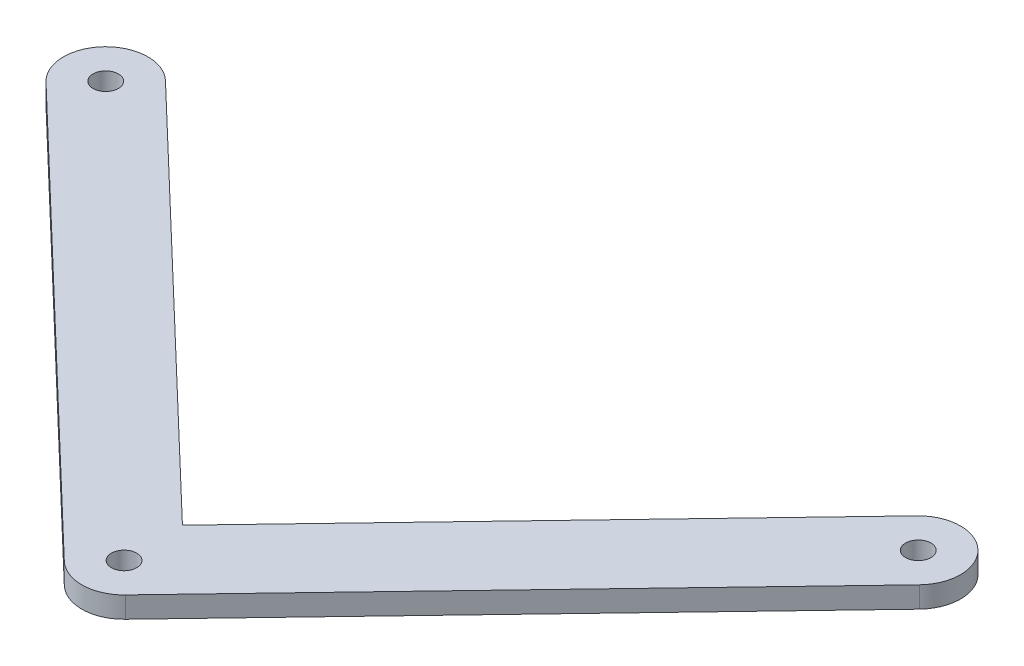
ISO-10303-21;
HEADER;
FILE_DESCRIPTION(('STEP AP214'),'2;1');
FILE_NAME('part.step','',(''),(''),'','','');
FILE_SCHEMA(('AUTOMOTIVE_DESIGN { 1 0 10303 214 1 1 1 1 }'));
ENDSEC;
DATA;
#1=APPLICATION_CONTEXT('core data for automotive mechanical design processes');
#2=APPLICATION_PROTOCOL_DEFINITION('international standard','automotive_design',2000,#1);
#3=PRODUCT_CONTEXT('',#1,'mechanical');
#4=PRODUCT('Part','Part','',(#3));
#5=PRODUCT_RELATED_PRODUCT_CATEGORY('part','',(#4));
#6=PRODUCT_DEFINITION_FORMATION('','',#4);
#7=PRODUCT_DEFINITION_CONTEXT('part definition',#1,'design');
#8=PRODUCT_DEFINITION('design','',#6,#7);
#9=PRODUCT_DEFINITION_SHAPE('','',#8);
#10=(LENGTH_UNIT() NAMED_UNIT(*) SI_UNIT(.MILLI.,.METRE.));
#11=(NAMED_UNIT(*) PLANE_ANGLE_UNIT() SI_UNIT($,.RADIAN.));
#12=(NAMED_UNIT(*) SI_UNIT($,.STERADIAN.) SOLID_ANGLE_UNIT());
#13=UNCERTAINTY_MEASURE_WITH_UNIT(LENGTH_MEASURE(1.E-05),#10,'distance_accuracy_value','');
#14=(GEOMETRIC_REPRESENTATION_CONTEXT(3) GLOBAL_UNCERTAINTY_ASSIGNED_CONTEXT((#13)) GLOBAL_UNIT_ASSIGNED_CONTEXT((#10,
#11,#12)) REPRESENTATION_CONTEXT('',''));
#15=CARTESIAN_POINT('',(0.,0.,0.));
#16=DIRECTION('',(0.,0.,1.));
#17=DIRECTION('',(1.,0.,0.));
#18=AXIS2_PLACEMENT_3D('',#15,#16,#17);
#19=CARTESIAN_POINT('',(0.,5.,0.));
#20=DIRECTION('',(0.,1.,0.));
#21=DIRECTION('',(0.,0.,1.));
#22=AXIS2_PLACEMENT_3D('',#19,#20,#21);
#23=PLANE('',#22);
#24=CARTESIAN_POINT('',(91.9483948435388,5.,-96.0962678031602));
#25=DIRECTION('',(0.,1.,0.));
#26=DIRECTION('',(0.,0.,1.));
#27=AXIS2_PLACEMENT_3D('',#24,#25,#26);
#28=CIRCLE('',#27,3.00000000000001);
#29=CARTESIAN_POINT('',(91.9483948435388,5.,-93.0962678031602));
#30=VERTEX_POINT('',#29);
#31=EDGE_CURVE('E170',#30,#30,#28,.T.);
#32=ORIENTED_EDGE('',*,*,#31,.F.);
#33=EDGE_LOOP('',(#32));
#34=FACE_BOUND('',#33,.T.);
#35=CARTESIAN_POINT('',(0.,5.,0.));
#36=DIRECTION('',(0.,1.,0.));
#37=DIRECTION('',(0.,0.,1.));
#38=AXIS2_PLACEMENT_3D('',#35,#36,#37);
#39=CIRCLE('',#38,10.);
#40=CARTESIAN_POINT('',(-6.91340056137843,5.,7.2252953349972));
#41=VERTEX_POINT('',#40);
#42=CARTESIAN_POINT('',(7.22528329347069,5.,6.91341314613074));
#43=VERTEX_POINT('',#42);
#44=EDGE_CURVE('E143',#41,#43,#39,.T.);
#45=ORIENTED_EDGE('',*,*,#44,.T.);
#46=DIRECTION('',(0.691341314613074,0.,-0.722528329347069));
#47=VECTOR('',#46,1.);
#48=CARTESIAN_POINT('',(7.22528329347069,5.,6.91341314613074));
#49=LINE('',#48,#47);
#50=CARTESIAN_POINT('',(99.1736781370095,5.,-89.1828546570295));
#51=VERTEX_POINT('',#50);
#52=EDGE_CURVE('E96',#43,#51,#49,.T.);
#53=ORIENTED_EDGE('',*,*,#52,.T.);
#54=CARTESIAN_POINT('',(91.9483948435388,5.,-96.0962678031602));
#55=DIRECTION('',(0.,1.,0.));
#56=DIRECTION('',(0.,0.,1.));
#57=AXIS2_PLACEMENT_3D('',#54,#55,#56);
#58=CIRCLE('',#57,10.);
#59=CARTESIAN_POINT('',(84.7231115500681,5.,-103.009680949291));
#60=VERTEX_POINT('',#59);
#61=EDGE_CURVE('E155',#51,#60,#58,.T.);
#62=ORIENTED_EDGE('',*,*,#61,.T.);
#63=DIRECTION('',(-0.691341314613074,0.,0.722528329347069));
#64=VECTOR('',#63,1.);
#65=CARTESIAN_POINT('',(-0.311882188866944,5.,-14.1386838548706));
#66=LINE('',#65,#64);
#67=CARTESIAN_POINT('',(-0.311882188866944,5.,-14.1386838548706));
#68=VERTEX_POINT('',#67);
#69=EDGE_CURVE('E112',#60,#68,#66,.T.);
#70=ORIENTED_EDGE('',*,*,#69,.T.);
#71=DIRECTION('',(-0.722529533499721,0.,-0.691340056137843));
#72=VECTOR('',#71,1.);
#73=CARTESIAN_POINT('',(-93.5182045950828,5.,-103.321563138157));
#74=LINE('',#73,#72);
#75=CARTESIAN_POINT('',(-93.5182045950828,5.,-103.321563138157));
#76=VERTEX_POINT('',#75);
#77=EDGE_CURVE('E106',#68,#76,#74,.T.);
#78=ORIENTED_EDGE('',*,*,#77,.T.);
#79=CARTESIAN_POINT('',(-100.431605156461,5.,-96.0962678031602));
#80=DIRECTION('',(0.,1.,0.));
#81=DIRECTION('',(0.,0.,1.));
#82=AXIS2_PLACEMENT_3D('',#79,#80,#81);
#83=CIRCLE('',#82,10.);
#84=CARTESIAN_POINT('',(-107.34500571784,5.,-88.870972468163));
#85=VERTEX_POINT('',#84);
#86=EDGE_CURVE('E110',#76,#85,#83,.T.);
#87=ORIENTED_EDGE('',*,*,#86,.T.);
#88=DIRECTION('',(0.722529533499721,0.,0.691340056137843));
#89=VECTOR('',#88,1.);
#90=CARTESIAN_POINT('',(-107.34500571784,5.,-88.870972468163));
#91=LINE('',#90,#89);
#92=EDGE_CURVE('E56',#85,#41,#91,.T.);
#93=ORIENTED_EDGE('',*,*,#92,.T.);
#94=EDGE_LOOP('',(#45,#53,#62,#70,#78,#87,#93));
#95=FACE_BOUND('',#94,.T.);
#96=CARTESIAN_POINT('',(-100.431605156461,5.,-96.0962678031602));
#97=DIRECTION('',(0.,1.,0.));
#98=DIRECTION('',(0.,0.,1.));
#99=AXIS2_PLACEMENT_3D('',#96,#97,#98);
#100=CIRCLE('',#99,3.00000000000001);
#101=CARTESIAN_POINT('',(-100.431605156461,5.,-93.0962678031602));
#102=VERTEX_POINT('',#101);
#103=EDGE_CURVE('E134',#102,#102,#100,.T.);
#104=ORIENTED_EDGE('',*,*,#103,.F.);
#105=EDGE_LOOP('',(#104));
#106=FACE_BOUND('',#105,.T.);
#107=CARTESIAN_POINT('',(0.,5.,0.));
#108=DIRECTION('',(0.,1.,0.));
#109=DIRECTION('',(0.,0.,1.));
#110=AXIS2_PLACEMENT_3D('',#107,#108,#109);
#111=CIRCLE('',#110,3.);
#112=CARTESIAN_POINT('',(0.,5.,3.));
#113=VERTEX_POINT('',#112);
#114=EDGE_CURVE('E176',#113,#113,#111,.T.);
#115=ORIENTED_EDGE('',*,*,#114,.F.);
#116=EDGE_LOOP('',(#115));
#117=FACE_BOUND('',#116,.T.);
#118=ADVANCED_FACE('F39',(#34,#95,#106,#117),#23,.T.);
#119=CARTESIAN_POINT('',(0.,0.,0.));
#120=DIRECTION('',(0.,1.,0.));
#121=DIRECTION('',(0.,0.,1.));
#122=AXIS2_PLACEMENT_3D('',#119,#120,#121);
#123=PLANE('',#122);
#124=CARTESIAN_POINT('',(0.,0.,0.));
#125=DIRECTION('',(0.,1.,0.));
#126=DIRECTION('',(0.,0.,1.));
#127=AXIS2_PLACEMENT_3D('',#124,#125,#126);
#128=CIRCLE('',#127,10.);
#129=CARTESIAN_POINT('',(-6.91340056137843,0.,7.2252953349972));
#130=VERTEX_POINT('',#129);
#131=CARTESIAN_POINT('',(7.22528329347069,0.,6.91341314613074));
#132=VERTEX_POINT('',#131);
#133=EDGE_CURVE('E130',#130,#132,#128,.T.);
#134=ORIENTED_EDGE('',*,*,#133,.F.);
#135=DIRECTION('',(0.722529533499721,0.,0.691340056137843));
#136=VECTOR('',#135,1.);
#137=CARTESIAN_POINT('',(-107.34500571784,0.,-88.870972468163));
#138=LINE('',#137,#136);
#139=CARTESIAN_POINT('',(-107.34500571784,0.,-88.870972468163));
#140=VERTEX_POINT('',#139);
#141=EDGE_CURVE('E88',#140,#130,#138,.T.);
#142=ORIENTED_EDGE('',*,*,#141,.F.);
#143=CARTESIAN_POINT('',(-100.431605156461,0.,-96.0962678031602));
#144=DIRECTION('',(0.,1.,0.));
#145=DIRECTION('',(0.,0.,1.));
#146=AXIS2_PLACEMENT_3D('',#143,#144,#145);
#147=CIRCLE('',#146,10.);
#148=CARTESIAN_POINT('',(-93.5182045950828,0.,-103.321563138157));
#149=VERTEX_POINT('',#148);
#150=EDGE_CURVE('E82',#149,#140,#147,.T.);
#151=ORIENTED_EDGE('',*,*,#150,.F.);
#152=DIRECTION('',(-0.722529533499721,0.,-0.691340056137843));
#153=VECTOR('',#152,1.);
#154=CARTESIAN_POINT('',(-93.5182045950828,0.,-103.321563138157));
#155=LINE('',#154,#153);
#156=CARTESIAN_POINT('',(-0.311882188866944,0.,-14.1386838548706));
#157=VERTEX_POINT('',#156);
#158=EDGE_CURVE('E120',#157,#149,#155,.T.);
#159=ORIENTED_EDGE('',*,*,#158,.F.);
#160=DIRECTION('',(-0.691341314613074,0.,0.722528329347069));
#161=VECTOR('',#160,1.);
#162=CARTESIAN_POINT('',(-0.311882188866944,0.,-14.1386838548706));
#163=LINE('',#162,#161);
#164=CARTESIAN_POINT('',(84.7231115500681,0.,-103.009680949291));
#165=VERTEX_POINT('',#164);
#166=EDGE_CURVE('E138',#165,#157,#163,.T.);
#167=ORIENTED_EDGE('',*,*,#166,.F.);
#168=CARTESIAN_POINT('',(91.9483948435388,0.,-96.0962678031602));
#169=DIRECTION('',(0.,1.,0.));
#170=DIRECTION('',(0.,0.,1.));
#171=AXIS2_PLACEMENT_3D('',#168,#169,#170);
#172=CIRCLE('',#171,10.);
#173=CARTESIAN_POINT('',(99.1736781370095,0.,-89.1828546570295));
#174=VERTEX_POINT('',#173);
#175=EDGE_CURVE('E136',#174,#165,#172,.T.);
#176=ORIENTED_EDGE('',*,*,#175,.F.);
#177=DIRECTION('',(0.691341314613074,0.,-0.722528329347069));
#178=VECTOR('',#177,1.);
#179=CARTESIAN_POINT('',(7.22528329347069,0.,6.91341314613074));
#180=LINE('',#179,#178);
#181=EDGE_CURVE('E133',#132,#174,#180,.T.);
#182=ORIENTED_EDGE('',*,*,#181,.F.);
#183=EDGE_LOOP('',(#134,#142,#151,#159,#167,#176,#182));
#184=FACE_BOUND('',#183,.T.);
#185=CARTESIAN_POINT('',(-100.431605156461,0.,-96.0962678031602));
#186=DIRECTION('',(0.,1.,0.));
#187=DIRECTION('',(0.,0.,1.));
#188=AXIS2_PLACEMENT_3D('',#185,#186,#187);
#189=CIRCLE('',#188,3.00000000000001);
#190=CARTESIAN_POINT('',(-100.431605156461,0.,-93.0962678031602));
#191=VERTEX_POINT('',#190);
#192=EDGE_CURVE('E167',#191,#191,#189,.T.);
#193=ORIENTED_EDGE('',*,*,#192,.T.);
#194=EDGE_LOOP('',(#193));
#195=FACE_BOUND('',#194,.T.);
#196=CARTESIAN_POINT('',(91.9483948435388,0.,-96.0962678031602));
#197=DIRECTION('',(0.,1.,0.));
#198=DIRECTION('',(0.,0.,1.));
#199=AXIS2_PLACEMENT_3D('',#196,#197,#198);
#200=CIRCLE('',#199,3.00000000000001);
#201=CARTESIAN_POINT('',(91.9483948435388,0.,-93.0962678031602));
#202=VERTEX_POINT('',#201);
#203=EDGE_CURVE('E173',#202,#202,#200,.T.);
#204=ORIENTED_EDGE('',*,*,#203,.T.);
#205=EDGE_LOOP('',(#204));
#206=FACE_BOUND('',#205,.T.);
#207=CARTESIAN_POINT('',(0.,0.,0.));
#208=DIRECTION('',(0.,1.,0.));
#209=DIRECTION('',(0.,0.,1.));
#210=AXIS2_PLACEMENT_3D('',#207,#208,#209);
#211=CIRCLE('',#210,3.);
#212=CARTESIAN_POINT('',(0.,0.,3.));
#213=VERTEX_POINT('',#212);
#214=EDGE_CURVE('E179',#213,#213,#211,.T.);
#215=ORIENTED_EDGE('',*,*,#214,.T.);
#216=EDGE_LOOP('',(#215));
#217=FACE_BOUND('',#216,.T.);
#218=ADVANCED_FACE('F159',(#184,#195,#206,#217),#123,.F.);
#219=CARTESIAN_POINT('',(0.,5.,0.));
#220=DIRECTION('',(0.,-1.,0.));
#221=DIRECTION('',(0.,0.,-1.));
#222=AXIS2_PLACEMENT_3D('',#219,#220,#221);
#223=CYLINDRICAL_SURFACE('',#222,10.);
#224=ORIENTED_EDGE('',*,*,#133,.T.);
#225=DIRECTION('',(0.,-1.,0.));
#226=VECTOR('',#225,1.);
#227=CARTESIAN_POINT('',(7.22528329347069,5.,6.91341314613074));
#228=LINE('',#227,#226);
#229=EDGE_CURVE('E11',#43,#132,#228,.T.);
#230=ORIENTED_EDGE('',*,*,#229,.F.);
#231=ORIENTED_EDGE('',*,*,#44,.F.);
#232=DIRECTION('',(0.,-1.,0.));
#233=VECTOR('',#232,1.);
#234=CARTESIAN_POINT('',(-6.91340056137843,5.,7.2252953349972));
#235=LINE('',#234,#233);
#236=EDGE_CURVE('E126',#41,#130,#235,.T.);
#237=ORIENTED_EDGE('',*,*,#236,.T.);
#238=EDGE_LOOP('',(#224,#230,#231,#237));
#239=FACE_BOUND('',#238,.T.);
#240=ADVANCED_FACE('F41',(#239),#223,.T.);
#241=CARTESIAN_POINT('',(7.22528329347069,5.,6.91341314613074));
#242=DIRECTION('',(-0.722528329347069,0.,-0.691341314613074));
#243=DIRECTION('',(-0.691341314613074,0.,0.722528329347069));
#244=AXIS2_PLACEMENT_3D('',#241,#242,#243);
#245=PLANE('',#244);
#246=ORIENTED_EDGE('',*,*,#181,.T.);
#247=DIRECTION('',(0.,-1.,0.));
#248=VECTOR('',#247,1.);
#249=CARTESIAN_POINT('',(99.1736781370095,5.,-89.1828546570295));
#250=LINE('',#249,#248);
#251=EDGE_CURVE('E48',#51,#174,#250,.T.);
#252=ORIENTED_EDGE('',*,*,#251,.F.);
#253=ORIENTED_EDGE('',*,*,#52,.F.);
#254=ORIENTED_EDGE('',*,*,#229,.T.);
#255=EDGE_LOOP('',(#246,#252,#253,#254));
#256=FACE_BOUND('',#255,.T.);
#257=ADVANCED_FACE('F210',(#256),#245,.F.);
#258=CARTESIAN_POINT('',(91.9483948435388,5.,-96.0962678031602));
#259=DIRECTION('',(0.,-1.,0.));
#260=DIRECTION('',(0.,0.,-1.));
#261=AXIS2_PLACEMENT_3D('',#258,#259,#260);
#262=CYLINDRICAL_SURFACE('',#261,10.);
#263=ORIENTED_EDGE('',*,*,#175,.T.);
#264=DIRECTION('',(0.,-1.,0.));
#265=VECTOR('',#264,1.);
#266=CARTESIAN_POINT('',(84.7231115500681,5.,-103.009680949291));
#267=LINE('',#266,#265);
#268=EDGE_CURVE('E147',#60,#165,#267,.T.);
#269=ORIENTED_EDGE('',*,*,#268,.F.);
#270=ORIENTED_EDGE('',*,*,#61,.F.);
#271=ORIENTED_EDGE('',*,*,#251,.T.);
#272=EDGE_LOOP('',(#263,#269,#270,#271));
#273=FACE_BOUND('',#272,.T.);
#274=ADVANCED_FACE('F153',(#273),#262,.T.);
#275=CARTESIAN_POINT('',(-0.311882188866944,5.,-14.1386838548706));
#276=DIRECTION('',(0.722528329347069,0.,0.691341314613074));
#277=DIRECTION('',(0.691341314613074,0.,-0.722528329347069));
#278=AXIS2_PLACEMENT_3D('',#275,#276,#277);
#279=PLANE('',#278);
#280=ORIENTED_EDGE('',*,*,#166,.T.);
#281=DIRECTION('',(0.,-1.,0.));
#282=VECTOR('',#281,1.);
#283=CARTESIAN_POINT('',(-0.311882188866944,5.,-14.1386838548706));
#284=LINE('',#283,#282);
#285=EDGE_CURVE('E121',#68,#157,#284,.T.);
#286=ORIENTED_EDGE('',*,*,#285,.F.);
#287=ORIENTED_EDGE('',*,*,#69,.F.);
#288=ORIENTED_EDGE('',*,*,#268,.T.);
#289=EDGE_LOOP('',(#280,#286,#287,#288));
#290=FACE_BOUND('',#289,.T.);
#291=ADVANCED_FACE('F162',(#290),#279,.F.);
#292=CARTESIAN_POINT('',(-93.5182045950828,5.,-103.321563138157));
#293=DIRECTION('',(-0.691340056137843,0.,0.722529533499721));
#294=DIRECTION('',(0.722529533499721,0.,0.691340056137843));
#295=AXIS2_PLACEMENT_3D('',#292,#293,#294);
#296=PLANE('',#295);
#297=ORIENTED_EDGE('',*,*,#158,.T.);
#298=DIRECTION('',(0.,-1.,0.));
#299=VECTOR('',#298,1.);
#300=CARTESIAN_POINT('',(-93.5182045950828,5.,-103.321563138157));
#301=LINE('',#300,#299);
#302=EDGE_CURVE('E117',#76,#149,#301,.T.);
#303=ORIENTED_EDGE('',*,*,#302,.F.);
#304=ORIENTED_EDGE('',*,*,#77,.F.);
#305=ORIENTED_EDGE('',*,*,#285,.T.);
#306=EDGE_LOOP('',(#297,#303,#304,#305));
#307=FACE_BOUND('',#306,.T.);
#308=ADVANCED_FACE('F118',(#307),#296,.F.);
#309=CARTESIAN_POINT('',(-100.431605156461,5.,-96.0962678031602));
#310=DIRECTION('',(0.,-1.,0.));
#311=DIRECTION('',(0.,0.,-1.));
#312=AXIS2_PLACEMENT_3D('',#309,#310,#311);
#313=CYLINDRICAL_SURFACE('',#312,10.);
#314=ORIENTED_EDGE('',*,*,#150,.T.);
#315=DIRECTION('',(0.,-1.,0.));
#316=VECTOR('',#315,1.);
#317=CARTESIAN_POINT('',(-107.34500571784,5.,-88.870972468163));
#318=LINE('',#317,#316);
#319=EDGE_CURVE('E122',#85,#140,#318,.T.);
#320=ORIENTED_EDGE('',*,*,#319,.F.);
#321=ORIENTED_EDGE('',*,*,#86,.F.);
#322=ORIENTED_EDGE('',*,*,#302,.T.);
#323=EDGE_LOOP('',(#314,#320,#321,#322));
#324=FACE_BOUND('',#323,.T.);
#325=ADVANCED_FACE('F124',(#324),#313,.T.);
#326=CARTESIAN_POINT('',(-107.34500571784,5.,-88.870972468163));
#327=DIRECTION('',(0.691340056137843,0.,-0.722529533499721));
#328=DIRECTION('',(-0.722529533499721,0.,-0.691340056137843));
#329=AXIS2_PLACEMENT_3D('',#326,#327,#328);
#330=PLANE('',#329);
#331=ORIENTED_EDGE('',*,*,#141,.T.);
#332=ORIENTED_EDGE('',*,*,#236,.F.);
#333=ORIENTED_EDGE('',*,*,#92,.F.);
#334=ORIENTED_EDGE('',*,*,#319,.T.);
#335=EDGE_LOOP('',(#331,#332,#333,#334));
#336=FACE_BOUND('',#335,.T.);
#337=ADVANCED_FACE('F200',(#336),#330,.F.);
#338=CARTESIAN_POINT('',(-100.431605156461,5.,-96.0962678031602));
#339=DIRECTION('',(0.,-1.,0.));
#340=DIRECTION('',(0.,0.,-1.));
#341=AXIS2_PLACEMENT_3D('',#338,#339,#340);
#342=CYLINDRICAL_SURFACE('',#341,3.00000000000001);
#343=ORIENTED_EDGE('',*,*,#103,.T.);
#344=EDGE_LOOP('',(#343));
#345=FACE_BOUND('',#344,.T.);
#346=ORIENTED_EDGE('',*,*,#192,.F.);
#347=EDGE_LOOP('',(#346));
#348=FACE_BOUND('',#347,.T.);
#349=ADVANCED_FACE('F197',(#345,#348),#342,.F.);
#350=CARTESIAN_POINT('',(91.9483948435388,5.,-96.0962678031602));
#351=DIRECTION('',(0.,-1.,0.));
#352=DIRECTION('',(0.,0.,-1.));
#353=AXIS2_PLACEMENT_3D('',#350,#351,#352);
#354=CYLINDRICAL_SURFACE('',#353,3.00000000000001);
#355=ORIENTED_EDGE('',*,*,#31,.T.);
#356=EDGE_LOOP('',(#355));
#357=FACE_BOUND('',#356,.T.);
#358=ORIENTED_EDGE('',*,*,#203,.F.);
#359=EDGE_LOOP('',(#358));
#360=FACE_BOUND('',#359,.T.);
#361=ADVANCED_FACE('F280',(#357,#360),#354,.F.);
#362=CARTESIAN_POINT('',(0.,5.,0.));
#363=DIRECTION('',(0.,-1.,0.));
#364=DIRECTION('',(0.,0.,-1.));
#365=AXIS2_PLACEMENT_3D('',#362,#363,#364);
#366=CYLINDRICAL_SURFACE('',#365,3.);
#367=ORIENTED_EDGE('',*,*,#114,.T.);
#368=EDGE_LOOP('',(#367));
#369=FACE_BOUND('',#368,.T.);
#370=ORIENTED_EDGE('',*,*,#214,.F.);
#371=EDGE_LOOP('',(#370));
#372=FACE_BOUND('',#371,.T.);
#373=ADVANCED_FACE('F185',(#369,#372),#366,.F.);
#374=CLOSED_SHELL('',(#118,#218,#240,#257,#274,#291,#308,#325,#337,#349,#361,#373));
#375=MANIFOLD_SOLID_BREP('B2',#374);
#376=ADVANCED_BREP_SHAPE_REPRESENTATION('',(#18,#375),#14);
#377=SHAPE_DEFINITION_REPRESENTATION(#9,#376);
ENDSEC;
END-ISO-10303-21;
